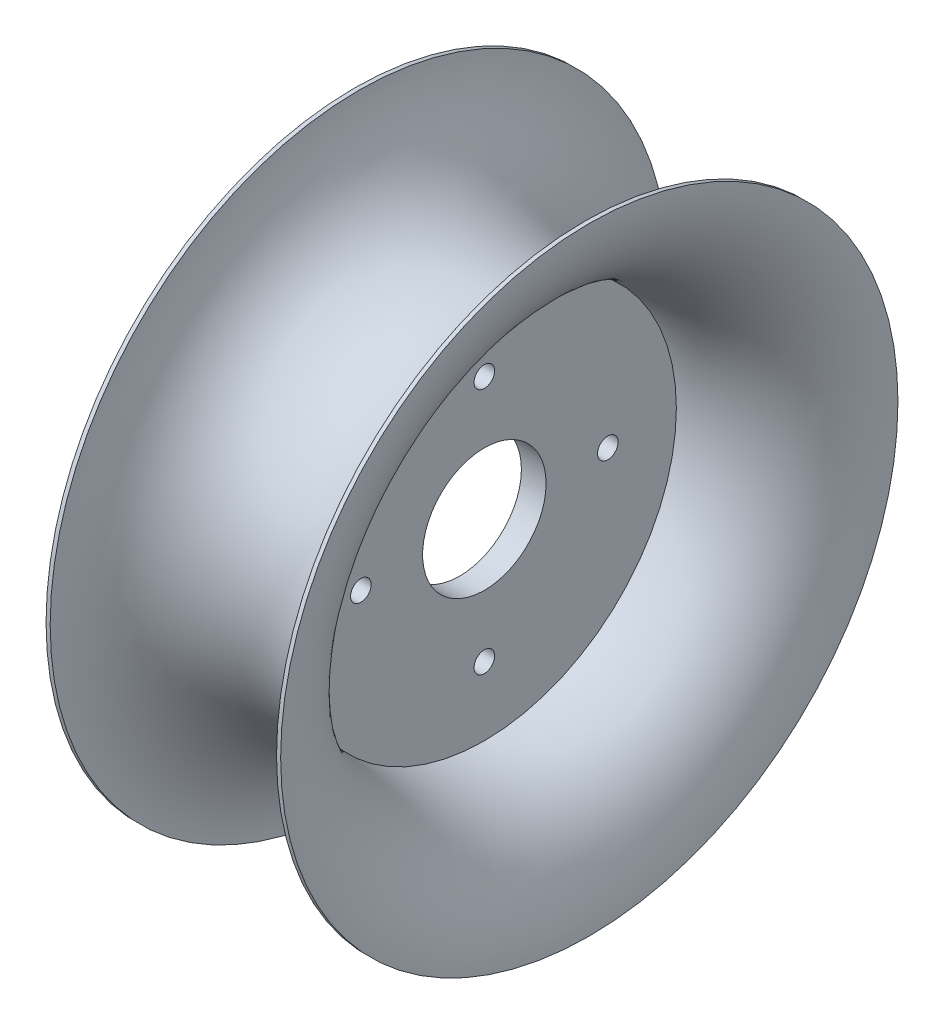
ISO-10303-21;
HEADER;
FILE_DESCRIPTION(('STEP AP214'),'2;1');
FILE_NAME('part.step','',(''),(''),'','','');
FILE_SCHEMA(('AUTOMOTIVE_DESIGN { 1 0 10303 214 1 1 1 1 }'));
ENDSEC;
DATA;
#1=APPLICATION_CONTEXT('core data for automotive mechanical design processes');
#2=APPLICATION_PROTOCOL_DEFINITION('international standard','automotive_design',2000,#1);
#3=PRODUCT_CONTEXT('',#1,'mechanical');
#4=PRODUCT('Part','Part','',(#3));
#5=PRODUCT_RELATED_PRODUCT_CATEGORY('part','',(#4));
#6=PRODUCT_DEFINITION_FORMATION('','',#4);
#7=PRODUCT_DEFINITION_CONTEXT('part definition',#1,'design');
#8=PRODUCT_DEFINITION('design','',#6,#7);
#9=PRODUCT_DEFINITION_SHAPE('','',#8);
#10=(LENGTH_UNIT() NAMED_UNIT(*) SI_UNIT(.MILLI.,.METRE.));
#11=(NAMED_UNIT(*) PLANE_ANGLE_UNIT() SI_UNIT($,.RADIAN.));
#12=(NAMED_UNIT(*) SI_UNIT($,.STERADIAN.) SOLID_ANGLE_UNIT());
#13=UNCERTAINTY_MEASURE_WITH_UNIT(LENGTH_MEASURE(1.E-05),#10,'distance_accuracy_value','');
#14=(GEOMETRIC_REPRESENTATION_CONTEXT(3) GLOBAL_UNCERTAINTY_ASSIGNED_CONTEXT((#13)) GLOBAL_UNIT_ASSIGNED_CONTEXT((#10,
#11,#12)) REPRESENTATION_CONTEXT('',''));
#15=CARTESIAN_POINT('',(0.,0.,0.));
#16=DIRECTION('',(0.,0.,1.));
#17=DIRECTION('',(1.,0.,0.));
#18=AXIS2_PLACEMENT_3D('',#15,#16,#17);
#19=CARTESIAN_POINT('',(0.,0.,0.));
#20=DIRECTION('',(-1.,0.,0.));
#21=DIRECTION('',(0.,0.,1.));
#22=AXIS2_PLACEMENT_3D('',#19,#20,#21);
#23=TOROIDAL_SURFACE('',#22,75.,28.5);
#24=CARTESIAN_POINT('',(-3.,0.,0.));
#25=DIRECTION('',(-1.,0.,0.));
#26=DIRECTION('',(0.,0.,1.));
#27=AXIS2_PLACEMENT_3D('',#24,#25,#26);
#28=CIRCLE('',#27,46.6583345584632);
#29=CARTESIAN_POINT('',(-3.,0.,46.6583345584632));
#30=VERTEX_POINT('',#29);
#31=EDGE_CURVE('E11',#30,#30,#28,.F.);
#32=ORIENTED_EDGE('',*,*,#31,.T.);
#33=EDGE_LOOP('',(#32));
#34=FACE_BOUND('',#33,.T.);
#35=CARTESIAN_POINT('',(-28.4999999266735,0.,0.));
#36=DIRECTION('',(1.,0.,0.));
#37=DIRECTION('',(0.,0.,-1.));
#38=AXIS2_PLACEMENT_3D('',#35,#36,#37);
#39=CIRCLE('',#38,74.997955589568);
#40=CARTESIAN_POINT('',(-28.4999999266735,0.,-74.997955589568));
#41=VERTEX_POINT('',#40);
#42=EDGE_CURVE('E430',#41,#41,#39,.T.);
#43=ORIENTED_EDGE('',*,*,#42,.F.);
#44=EDGE_LOOP('',(#43));
#45=FACE_BOUND('',#44,.T.);
#46=ADVANCED_FACE('F426',(#34,#45),#23,.T.);
#47=CARTESIAN_POINT('',(3.,0.,0.));
#48=DIRECTION('',(-1.,0.,0.));
#49=DIRECTION('',(0.,0.,1.));
#50=AXIS2_PLACEMENT_3D('',#47,#48,#49);
#51=CIRCLE('',#50,46.6583345584632);
#52=CARTESIAN_POINT('',(3.,0.,46.6583345584632));
#53=VERTEX_POINT('',#52);
#54=EDGE_CURVE('E465',#53,#53,#51,.F.);
#55=ORIENTED_EDGE('',*,*,#54,.F.);
#56=EDGE_LOOP('',(#55));
#57=FACE_BOUND('',#56,.T.);
#58=CARTESIAN_POINT('',(28.4999999266735,0.,0.));
#59=DIRECTION('',(-1.,0.,0.));
#60=DIRECTION('',(0.,0.,1.));
#61=AXIS2_PLACEMENT_3D('',#58,#59,#60);
#62=CIRCLE('',#61,74.997955589568);
#63=CARTESIAN_POINT('',(28.4999999266735,0.,74.997955589568));
#64=VERTEX_POINT('',#63);
#65=EDGE_CURVE('E473',#64,#64,#62,.T.);
#66=ORIENTED_EDGE('',*,*,#65,.F.);
#67=EDGE_LOOP('',(#66));
#68=FACE_BOUND('',#67,.T.);
#69=ADVANCED_FACE('F499',(#57,#68),#23,.T.);
#70=CARTESIAN_POINT('',(-3.,0.,0.));
#71=DIRECTION('',(1.,0.,0.));
#72=DIRECTION('',(0.,0.,-1.));
#73=AXIS2_PLACEMENT_3D('',#70,#71,#72);
#74=PLANE('',#73);
#75=CARTESIAN_POINT('',(-3.,0.,0.));
#76=DIRECTION('',(1.,0.,0.));
#77=DIRECTION('',(0.,0.,-1.));
#78=AXIS2_PLACEMENT_3D('',#75,#76,#77);
#79=CIRCLE('',#78,15.);
#80=CARTESIAN_POINT('',(-3.,0.,-15.));
#81=VERTEX_POINT('',#80);
#82=EDGE_CURVE('E434',#81,#81,#79,.T.);
#83=ORIENTED_EDGE('',*,*,#82,.T.);
#84=EDGE_LOOP('',(#83));
#85=FACE_BOUND('',#84,.T.);
#86=CARTESIAN_POINT('',(-3.,30.,0.));
#87=DIRECTION('',(1.,0.,0.));
#88=DIRECTION('',(0.,0.,-1.));
#89=AXIS2_PLACEMENT_3D('',#86,#87,#88);
#90=CIRCLE('',#89,2.49999999999991);
#91=CARTESIAN_POINT('',(-3.,30.,-2.49999999999994));
#92=VERTEX_POINT('',#91);
#93=EDGE_CURVE('E445',#92,#92,#90,.T.);
#94=ORIENTED_EDGE('',*,*,#93,.T.);
#95=EDGE_LOOP('',(#94));
#96=FACE_BOUND('',#95,.T.);
#97=CARTESIAN_POINT('',(-3.,2.22044604925031E-13,-30.));
#98=DIRECTION('',(1.,0.,0.));
#99=DIRECTION('',(0.,0.,-1.));
#100=AXIS2_PLACEMENT_3D('',#97,#98,#99);
#101=CIRCLE('',#100,2.5);
#102=CARTESIAN_POINT('',(-3.,2.22044604925031E-13,-32.5));
#103=VERTEX_POINT('',#102);
#104=EDGE_CURVE('E450',#103,#103,#101,.T.);
#105=ORIENTED_EDGE('',*,*,#104,.T.);
#106=EDGE_LOOP('',(#105));
#107=FACE_BOUND('',#106,.T.);
#108=CARTESIAN_POINT('',(-3.,-30.,0.));
#109=DIRECTION('',(1.,0.,0.));
#110=DIRECTION('',(0.,0.,-1.));
#111=AXIS2_PLACEMENT_3D('',#108,#109,#110);
#112=CIRCLE('',#111,2.49999999999997);
#113=CARTESIAN_POINT('',(-3.,-30.,-2.50000000000005));
#114=VERTEX_POINT('',#113);
#115=EDGE_CURVE('E454',#114,#114,#112,.T.);
#116=ORIENTED_EDGE('',*,*,#115,.T.);
#117=EDGE_LOOP('',(#116));
#118=FACE_BOUND('',#117,.T.);
#119=CARTESIAN_POINT('',(-3.,0.,30.0000000000001));
#120=DIRECTION('',(1.,0.,0.));
#121=DIRECTION('',(0.,0.,-1.));
#122=AXIS2_PLACEMENT_3D('',#119,#120,#121);
#123=CIRCLE('',#122,2.5);
#124=CARTESIAN_POINT('',(-3.,0.,27.5000000000001));
#125=VERTEX_POINT('',#124);
#126=EDGE_CURVE('E458',#125,#125,#123,.T.);
#127=ORIENTED_EDGE('',*,*,#126,.T.);
#128=EDGE_LOOP('',(#127));
#129=FACE_BOUND('',#128,.T.);
#130=ORIENTED_EDGE('',*,*,#31,.F.);
#131=EDGE_LOOP('',(#130));
#132=FACE_BOUND('',#131,.T.);
#133=ADVANCED_FACE('F428',(#85,#96,#107,#118,#129,#132),#74,.F.);
#134=CARTESIAN_POINT('',(3.,0.,0.));
#135=DIRECTION('',(1.,0.,0.));
#136=DIRECTION('',(0.,0.,-1.));
#137=AXIS2_PLACEMENT_3D('',#134,#135,#136);
#138=PLANE('',#137);
#139=CARTESIAN_POINT('',(3.,0.,0.));
#140=DIRECTION('',(1.,0.,0.));
#141=DIRECTION('',(0.,0.,-1.));
#142=AXIS2_PLACEMENT_3D('',#139,#140,#141);
#143=CIRCLE('',#142,15.);
#144=CARTESIAN_POINT('',(3.,0.,-15.));
#145=VERTEX_POINT('',#144);
#146=EDGE_CURVE('E439',#145,#145,#143,.T.);
#147=ORIENTED_EDGE('',*,*,#146,.F.);
#148=EDGE_LOOP('',(#147));
#149=FACE_BOUND('',#148,.T.);
#150=CARTESIAN_POINT('',(3.,30.,0.));
#151=DIRECTION('',(1.,0.,0.));
#152=DIRECTION('',(0.,0.,-1.));
#153=AXIS2_PLACEMENT_3D('',#150,#151,#152);
#154=CIRCLE('',#153,2.49999999999991);
#155=CARTESIAN_POINT('',(3.,30.,-2.49999999999994));
#156=VERTEX_POINT('',#155);
#157=EDGE_CURVE('E449',#156,#156,#154,.T.);
#158=ORIENTED_EDGE('',*,*,#157,.F.);
#159=EDGE_LOOP('',(#158));
#160=FACE_BOUND('',#159,.T.);
#161=CARTESIAN_POINT('',(3.,2.22044604925031E-13,-30.));
#162=DIRECTION('',(1.,0.,0.));
#163=DIRECTION('',(0.,0.,-1.));
#164=AXIS2_PLACEMENT_3D('',#161,#162,#163);
#165=CIRCLE('',#164,2.5);
#166=CARTESIAN_POINT('',(3.,2.22044604925031E-13,-32.5));
#167=VERTEX_POINT('',#166);
#168=EDGE_CURVE('E448',#167,#167,#165,.T.);
#169=ORIENTED_EDGE('',*,*,#168,.F.);
#170=EDGE_LOOP('',(#169));
#171=FACE_BOUND('',#170,.T.);
#172=CARTESIAN_POINT('',(3.,-30.,0.));
#173=DIRECTION('',(1.,0.,0.));
#174=DIRECTION('',(0.,0.,-1.));
#175=AXIS2_PLACEMENT_3D('',#172,#173,#174);
#176=CIRCLE('',#175,2.49999999999997);
#177=CARTESIAN_POINT('',(3.,-30.,-2.50000000000005));
#178=VERTEX_POINT('',#177);
#179=EDGE_CURVE('E453',#178,#178,#176,.T.);
#180=ORIENTED_EDGE('',*,*,#179,.F.);
#181=EDGE_LOOP('',(#180));
#182=FACE_BOUND('',#181,.T.);
#183=CARTESIAN_POINT('',(3.,0.,30.0000000000001));
#184=DIRECTION('',(1.,0.,0.));
#185=DIRECTION('',(0.,0.,-1.));
#186=AXIS2_PLACEMENT_3D('',#183,#184,#185);
#187=CIRCLE('',#186,2.5);
#188=CARTESIAN_POINT('',(3.,0.,27.5000000000001));
#189=VERTEX_POINT('',#188);
#190=EDGE_CURVE('E457',#189,#189,#187,.T.);
#191=ORIENTED_EDGE('',*,*,#190,.F.);
#192=EDGE_LOOP('',(#191));
#193=FACE_BOUND('',#192,.T.);
#194=ORIENTED_EDGE('',*,*,#54,.T.);
#195=EDGE_LOOP('',(#194));
#196=FACE_BOUND('',#195,.T.);
#197=ADVANCED_FACE('F524',(#149,#160,#171,#182,#193,#196),#138,.T.);
#198=CARTESIAN_POINT('',(-21.,0.,0.));
#199=DIRECTION('',(1.,0.,0.));
#200=DIRECTION('',(0.,0.,-1.));
#201=AXIS2_PLACEMENT_3D('',#198,#199,#200);
#202=CYLINDRICAL_SURFACE('',#201,15.);
#203=ORIENTED_EDGE('',*,*,#146,.T.);
#204=EDGE_LOOP('',(#203));
#205=FACE_BOUND('',#204,.T.);
#206=ORIENTED_EDGE('',*,*,#82,.F.);
#207=EDGE_LOOP('',(#206));
#208=FACE_BOUND('',#207,.T.);
#209=ADVANCED_FACE('F521',(#205,#208),#202,.F.);
#210=CARTESIAN_POINT('',(21.,30.,0.));
#211=DIRECTION('',(-1.,0.,0.));
#212=DIRECTION('',(0.,0.,1.));
#213=AXIS2_PLACEMENT_3D('',#210,#211,#212);
#214=CYLINDRICAL_SURFACE('',#213,2.49999999999991);
#215=ORIENTED_EDGE('',*,*,#157,.T.);
#216=EDGE_LOOP('',(#215));
#217=FACE_BOUND('',#216,.T.);
#218=ORIENTED_EDGE('',*,*,#93,.F.);
#219=EDGE_LOOP('',(#218));
#220=FACE_BOUND('',#219,.T.);
#221=ADVANCED_FACE('F517',(#217,#220),#214,.F.);
#222=CARTESIAN_POINT('',(21.,2.22044604925031E-13,-30.));
#223=DIRECTION('',(-1.,0.,0.));
#224=DIRECTION('',(0.,0.,1.));
#225=AXIS2_PLACEMENT_3D('',#222,#223,#224);
#226=CYLINDRICAL_SURFACE('',#225,2.5);
#227=ORIENTED_EDGE('',*,*,#168,.T.);
#228=EDGE_LOOP('',(#227));
#229=FACE_BOUND('',#228,.T.);
#230=ORIENTED_EDGE('',*,*,#104,.F.);
#231=EDGE_LOOP('',(#230));
#232=FACE_BOUND('',#231,.T.);
#233=ADVANCED_FACE('F513',(#229,#232),#226,.F.);
#234=CARTESIAN_POINT('',(21.,-30.,0.));
#235=DIRECTION('',(-1.,0.,0.));
#236=DIRECTION('',(0.,0.,1.));
#237=AXIS2_PLACEMENT_3D('',#234,#235,#236);
#238=CYLINDRICAL_SURFACE('',#237,2.49999999999997);
#239=ORIENTED_EDGE('',*,*,#179,.T.);
#240=EDGE_LOOP('',(#239));
#241=FACE_BOUND('',#240,.T.);
#242=ORIENTED_EDGE('',*,*,#115,.F.);
#243=EDGE_LOOP('',(#242));
#244=FACE_BOUND('',#243,.T.);
#245=ADVANCED_FACE('F509',(#241,#244),#238,.F.);
#246=CARTESIAN_POINT('',(21.,0.,30.0000000000001));
#247=DIRECTION('',(-1.,0.,0.));
#248=DIRECTION('',(0.,0.,1.));
#249=AXIS2_PLACEMENT_3D('',#246,#247,#248);
#250=CYLINDRICAL_SURFACE('',#249,2.5);
#251=ORIENTED_EDGE('',*,*,#190,.T.);
#252=EDGE_LOOP('',(#251));
#253=FACE_BOUND('',#252,.T.);
#254=ORIENTED_EDGE('',*,*,#126,.F.);
#255=EDGE_LOOP('',(#254));
#256=FACE_BOUND('',#255,.T.);
#257=ADVANCED_FACE('F497',(#253,#256),#250,.F.);
#258=CARTESIAN_POINT('',(-77.7522454632817,0.,0.));
#259=DIRECTION('',(-1.,0.,0.));
#260=DIRECTION('',(0.,0.,1.));
#261=AXIS2_PLACEMENT_3D('',#258,#259,#260);
#262=CYLINDRICAL_SURFACE('',#261,74.997955589568);
#263=CARTESIAN_POINT('',(-27.499999924007,0.,0.));
#264=DIRECTION('',(-1.,0.,0.));
#265=DIRECTION('',(0.,0.,1.));
#266=AXIS2_PLACEMENT_3D('',#263,#264,#265);
#267=CIRCLE('',#266,74.997955589568);
#268=CARTESIAN_POINT('',(-27.499999924007,0.,74.997955589568));
#269=VERTEX_POINT('',#268);
#270=EDGE_CURVE('E443',#269,#269,#267,.T.);
#271=ORIENTED_EDGE('',*,*,#270,.T.);
#272=EDGE_LOOP('',(#271));
#273=FACE_BOUND('',#272,.T.);
#274=ORIENTED_EDGE('',*,*,#42,.T.);
#275=EDGE_LOOP('',(#274));
#276=FACE_BOUND('',#275,.T.);
#277=ADVANCED_FACE('F490',(#273,#276),#262,.T.);
#278=CARTESIAN_POINT('',(27.499999924007,0.,0.));
#279=DIRECTION('',(-1.,0.,0.));
#280=DIRECTION('',(0.,0.,1.));
#281=AXIS2_PLACEMENT_3D('',#278,#279,#280);
#282=CIRCLE('',#281,74.997955589568);
#283=CARTESIAN_POINT('',(27.499999924007,0.,74.997955589568));
#284=VERTEX_POINT('',#283);
#285=EDGE_CURVE('E479',#284,#284,#282,.T.);
#286=ORIENTED_EDGE('',*,*,#285,.F.);
#287=EDGE_LOOP('',(#286));
#288=FACE_BOUND('',#287,.T.);
#289=ORIENTED_EDGE('',*,*,#65,.T.);
#290=EDGE_LOOP('',(#289));
#291=FACE_BOUND('',#290,.T.);
#292=ADVANCED_FACE('F488',(#288,#291),#262,.T.);
#293=CARTESIAN_POINT('',(0.,0.,0.));
#294=DIRECTION('',(-1.,0.,0.));
#295=DIRECTION('',(0.,0.,1.));
#296=AXIS2_PLACEMENT_3D('',#293,#294,#295);
#297=TOROIDAL_SURFACE('',#296,75.,27.5);
#298=ORIENTED_EDGE('',*,*,#285,.T.);
#299=EDGE_LOOP('',(#298));
#300=FACE_BOUND('',#299,.T.);
#301=ORIENTED_EDGE('',*,*,#270,.F.);
#302=EDGE_LOOP('',(#301));
#303=FACE_BOUND('',#302,.T.);
#304=ADVANCED_FACE('F485',(#300,#303),#297,.F.);
#305=CLOSED_SHELL('',(#46,#69,#133,#197,#209,#221,#233,#245,#257,#277,#292,#304));
#306=MANIFOLD_SOLID_BREP('B2',#305);
#307=ADVANCED_BREP_SHAPE_REPRESENTATION('',(#18,#306),#14);
#308=SHAPE_DEFINITION_REPRESENTATION(#9,#307);
ENDSEC;
END-ISO-10303-21;
